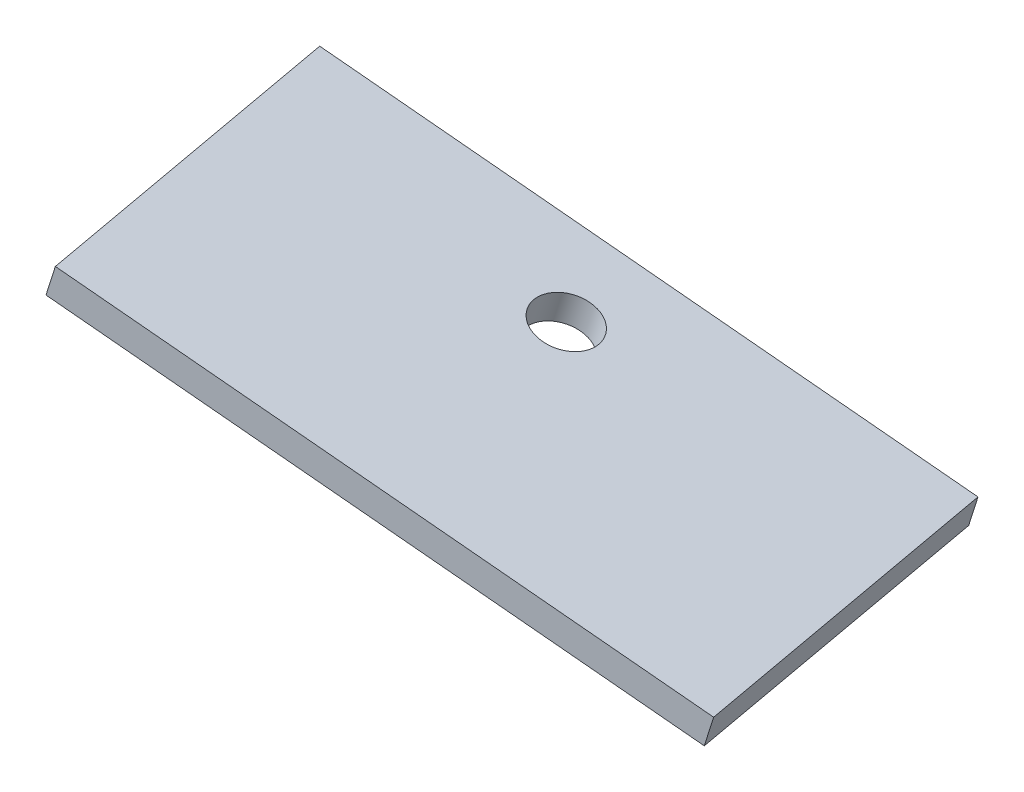
ISO-10303-21;
HEADER;
FILE_DESCRIPTION(('STEP AP214'),'2;1');
FILE_NAME('part.step','',(''),(''),'','','');
FILE_SCHEMA(('AUTOMOTIVE_DESIGN { 1 0 10303 214 1 1 1 1 }'));
ENDSEC;
DATA;
#1=APPLICATION_CONTEXT('core data for automotive mechanical design processes');
#2=APPLICATION_PROTOCOL_DEFINITION('international standard','automotive_design',2000,#1);
#3=PRODUCT_CONTEXT('',#1,'mechanical');
#4=PRODUCT('Part','Part','',(#3));
#5=PRODUCT_RELATED_PRODUCT_CATEGORY('part','',(#4));
#6=PRODUCT_DEFINITION_FORMATION('','',#4);
#7=PRODUCT_DEFINITION_CONTEXT('part definition',#1,'design');
#8=PRODUCT_DEFINITION('design','',#6,#7);
#9=PRODUCT_DEFINITION_SHAPE('','',#8);
#10=(LENGTH_UNIT() NAMED_UNIT(*) SI_UNIT(.MILLI.,.METRE.));
#11=(NAMED_UNIT(*) PLANE_ANGLE_UNIT() SI_UNIT($,.RADIAN.));
#12=(NAMED_UNIT(*) SI_UNIT($,.STERADIAN.) SOLID_ANGLE_UNIT());
#13=UNCERTAINTY_MEASURE_WITH_UNIT(LENGTH_MEASURE(1.E-05),#10,'distance_accuracy_value','');
#14=(GEOMETRIC_REPRESENTATION_CONTEXT(3) GLOBAL_UNCERTAINTY_ASSIGNED_CONTEXT((#13)) GLOBAL_UNIT_ASSIGNED_CONTEXT((#10,
#11,#12)) REPRESENTATION_CONTEXT('',''));
#15=CARTESIAN_POINT('',(0.,0.,0.));
#16=DIRECTION('',(0.,0.,1.));
#17=DIRECTION('',(1.,0.,0.));
#18=AXIS2_PLACEMENT_3D('',#15,#16,#17);
#19=CARTESIAN_POINT('',(301.223329106453,-73.6429692942688,480.400382547762));
#20=DIRECTION('',(0.178485715149537,0.,0.983942503141092));
#21=DIRECTION('',(0.983942503141092,0.,-0.178485715149537));
#22=AXIS2_PLACEMENT_3D('',#19,#20,#21);
#23=PLANE('',#22);
#24=DIRECTION('',(0.945853185860256,-0.275541830382092,-0.171576369316085));
#25=VECTOR('',#24,1.);
#26=CARTESIAN_POINT('',(301.765563743066,-71.7203911297098,480.302021986463));
#27=LINE('',#26,#25);
#28=CARTESIAN_POINT('',(301.765563743066,-71.7203911297098,480.302021986463));
#29=VERTEX_POINT('',#28);
#30=CARTESIAN_POINT('',(339.96359163014,-82.8480742398724,473.372956209793));
#31=VERTEX_POINT('',#30);
#32=EDGE_CURVE('E88',#29,#31,#27,.T.);
#33=ORIENTED_EDGE('',*,*,#32,.T.);
#34=DIRECTION('',(0.27111731830623,0.96128908227946,-0.0491802806493832));
#35=VECTOR('',#34,1.);
#36=CARTESIAN_POINT('',(339.421356993528,-84.7706524044313,473.471316771091));
#37=LINE('',#36,#35);
#38=CARTESIAN_POINT('',(339.421356993528,-84.7706524044313,473.471316771091));
#39=VERTEX_POINT('',#38);
#40=EDGE_CURVE('E42',#39,#31,#37,.T.);
#41=ORIENTED_EDGE('',*,*,#40,.F.);
#42=DIRECTION('',(0.945853185860256,-0.275541830382092,-0.171576369316085));
#43=VECTOR('',#42,1.);
#44=CARTESIAN_POINT('',(301.223329106453,-73.6429692942688,480.400382547762));
#45=LINE('',#44,#43);
#46=CARTESIAN_POINT('',(301.223329106453,-73.6429692942688,480.400382547762));
#47=VERTEX_POINT('',#46);
#48=EDGE_CURVE('E80',#47,#39,#45,.T.);
#49=ORIENTED_EDGE('',*,*,#48,.F.);
#50=DIRECTION('',(0.27111731830623,0.96128908227946,-0.0491802806493832));
#51=VECTOR('',#50,1.);
#52=CARTESIAN_POINT('',(301.223329106453,-73.6429692942688,480.400382547762));
#53=LINE('',#52,#51);
#54=EDGE_CURVE('E11',#47,#29,#53,.T.);
#55=ORIENTED_EDGE('',*,*,#54,.T.);
#56=EDGE_LOOP('',(#33,#41,#49,#55));
#57=FACE_BOUND('',#56,.T.);
#58=ADVANCED_FACE('F34',(#57),#23,.F.);
#59=CARTESIAN_POINT('',(343.437285584392,-84.7706524044308,495.610023091766));
#60=DIRECTION('',(-0.945853185860255,0.275541830382092,0.171576369316095));
#61=DIRECTION('',(-0.279689394053223,-0.960090538883777,0.));
#62=AXIS2_PLACEMENT_3D('',#59,#60,#61);
#63=PLANE('',#62);
#64=DIRECTION('',(0.178485715149546,0.,0.983942503141091));
#65=VECTOR('',#64,1.);
#66=CARTESIAN_POINT('',(343.979520221005,-82.8480742398719,495.511662530467));
#67=LINE('',#66,#65);
#68=CARTESIAN_POINT('',(343.979520221005,-82.8480742398719,495.511662530467));
#69=VERTEX_POINT('',#68);
#70=EDGE_CURVE('E67',#31,#69,#67,.T.);
#71=ORIENTED_EDGE('',*,*,#70,.T.);
#72=DIRECTION('',(0.27111731830623,0.96128908227946,-0.0491802806493832));
#73=VECTOR('',#72,1.);
#74=CARTESIAN_POINT('',(343.437285584392,-84.7706524044308,495.610023091766));
#75=LINE('',#74,#73);
#76=CARTESIAN_POINT('',(343.437285584392,-84.7706524044308,495.610023091766));
#77=VERTEX_POINT('',#76);
#78=EDGE_CURVE('E89',#77,#69,#75,.T.);
#79=ORIENTED_EDGE('',*,*,#78,.F.);
#80=DIRECTION('',(0.178485715149534,0.,0.983942503141093));
#81=VECTOR('',#80,1.);
#82=CARTESIAN_POINT('',(339.421356993528,-84.7706524044313,473.471316771091));
#83=LINE('',#82,#81);
#84=EDGE_CURVE('E84',#39,#77,#83,.T.);
#85=ORIENTED_EDGE('',*,*,#84,.F.);
#86=ORIENTED_EDGE('',*,*,#40,.T.);
#87=EDGE_LOOP('',(#71,#79,#85,#86));
#88=FACE_BOUND('',#87,.T.);
#89=ADVANCED_FACE('F90',(#88),#63,.F.);
#90=CARTESIAN_POINT('',(305.239257697318,-73.6429692942682,502.539088868436));
#91=DIRECTION('',(-0.178485715149545,0.,-0.983942503141091));
#92=DIRECTION('',(-0.983942503141091,0.,0.178485715149545));
#93=AXIS2_PLACEMENT_3D('',#90,#91,#92);
#94=PLANE('',#93);
#95=DIRECTION('',(-0.945853185860255,0.275541830382093,0.171576369316093));
#96=VECTOR('',#95,1.);
#97=CARTESIAN_POINT('',(305.78149233393,-71.7203911297093,502.440728307137));
#98=LINE('',#97,#96);
#99=CARTESIAN_POINT('',(305.78149233393,-71.7203911297093,502.440728307137));
#100=VERTEX_POINT('',#99);
#101=EDGE_CURVE('E74',#69,#100,#98,.T.);
#102=ORIENTED_EDGE('',*,*,#101,.T.);
#103=DIRECTION('',(0.27111731830623,0.96128908227946,-0.0491802806493832));
#104=VECTOR('',#103,1.);
#105=CARTESIAN_POINT('',(305.239257697318,-73.6429692942682,502.539088868436));
#106=LINE('',#105,#104);
#107=CARTESIAN_POINT('',(305.239257697318,-73.6429692942682,502.539088868436));
#108=VERTEX_POINT('',#107);
#109=EDGE_CURVE('E94',#108,#100,#106,.T.);
#110=ORIENTED_EDGE('',*,*,#109,.F.);
#111=DIRECTION('',(-0.945853185860255,0.275541830382093,0.171576369316093));
#112=VECTOR('',#111,1.);
#113=CARTESIAN_POINT('',(305.239257697318,-73.6429692942682,502.539088868436));
#114=LINE('',#113,#112);
#115=EDGE_CURVE('E92',#77,#108,#114,.T.);
#116=ORIENTED_EDGE('',*,*,#115,.F.);
#117=ORIENTED_EDGE('',*,*,#78,.T.);
#118=EDGE_LOOP('',(#102,#110,#116,#117));
#119=FACE_BOUND('',#118,.T.);
#120=ADVANCED_FACE('F105',(#119),#94,.F.);
#121=CARTESIAN_POINT('',(303.008186257949,-73.6429692942685,490.239807579172));
#122=DIRECTION('',(0.945853185860257,-0.275541830382092,-0.171576369316081));
#123=DIRECTION('',(0.279689394053222,0.960090538883777,0.));
#124=AXIS2_PLACEMENT_3D('',#121,#122,#123);
#125=PLANE('',#124);
#126=DIRECTION('',(-0.178485715149533,0.,-0.983942503141093));
#127=VECTOR('',#126,1.);
#128=CARTESIAN_POINT('',(303.550420894561,-71.7203911297096,490.141447017874));
#129=LINE('',#128,#127);
#130=EDGE_CURVE('E102',#100,#29,#129,.T.);
#131=ORIENTED_EDGE('',*,*,#130,.T.);
#132=ORIENTED_EDGE('',*,*,#54,.F.);
#133=DIRECTION('',(-0.17848571514954,0.,-0.983942503141092));
#134=VECTOR('',#133,1.);
#135=CARTESIAN_POINT('',(303.008186257949,-73.6429692942685,490.239807579172));
#136=LINE('',#135,#134);
#137=EDGE_CURVE('E50',#108,#47,#136,.T.);
#138=ORIENTED_EDGE('',*,*,#137,.F.);
#139=ORIENTED_EDGE('',*,*,#109,.T.);
#140=EDGE_LOOP('',(#131,#132,#138,#139));
#141=FACE_BOUND('',#140,.T.);
#142=ADVANCED_FACE('F109',(#141),#125,.F.);
#143=CARTESIAN_POINT('',(-3.4571651749431,-12.2579227290668,0.627124650749649));
#144=DIRECTION('',(-0.27111731830623,-0.96128908227946,0.0491802806493832));
#145=DIRECTION('',(0.962453730360486,-0.2714457900119,0.));
#146=AXIS2_PLACEMENT_3D('',#143,#144,#145);
#147=PLANE('',#146);
#148=CARTESIAN_POINT('',(320.690062878346,-79.0019593013298,482.96706311399));
#149=DIRECTION('',(-0.27111731830623,-0.96128908227946,0.0491802806493832));
#150=DIRECTION('',(0.962453730360486,-0.2714457900119,0.));
#151=AXIS2_PLACEMENT_3D('',#148,#149,#150);
#152=CIRCLE('',#151,2.);
#153=CARTESIAN_POINT('',(322.614970339067,-79.5448508813536,482.96706311399));
#154=VERTEX_POINT('',#153);
#155=EDGE_CURVE('E168',#154,#154,#152,.T.);
#156=ORIENTED_EDGE('',*,*,#155,.F.);
#157=EDGE_LOOP('',(#156));
#158=FACE_BOUND('',#157,.T.);
#159=ORIENTED_EDGE('',*,*,#137,.T.);
#160=ORIENTED_EDGE('',*,*,#48,.T.);
#161=ORIENTED_EDGE('',*,*,#84,.T.);
#162=ORIENTED_EDGE('',*,*,#115,.T.);
#163=EDGE_LOOP('',(#159,#160,#161,#162));
#164=FACE_BOUND('',#163,.T.);
#165=ADVANCED_FACE('F82',(#158,#164),#147,.T.);
#166=CARTESIAN_POINT('',(-2.91493053833064,-10.3353445645078,0.528764089450882));
#167=DIRECTION('',(-0.27111731830623,-0.96128908227946,0.0491802806493832));
#168=DIRECTION('',(0.962453730360486,-0.2714457900119,0.));
#169=AXIS2_PLACEMENT_3D('',#166,#167,#168);
#170=PLANE('',#169);
#171=CARTESIAN_POINT('',(321.232297514959,-77.0793811367709,482.868702552691));
#172=DIRECTION('',(-0.27111731830623,-0.96128908227946,0.0491802806493832));
#173=DIRECTION('',(0.962453730360486,-0.2714457900119,0.));
#174=AXIS2_PLACEMENT_3D('',#171,#172,#173);
#175=CIRCLE('',#174,2.);
#176=CARTESIAN_POINT('',(323.15720497568,-77.6222727167947,482.868702552691));
#177=VERTEX_POINT('',#176);
#178=EDGE_CURVE('E99',#177,#177,#175,.T.);
#179=ORIENTED_EDGE('',*,*,#178,.T.);
#180=EDGE_LOOP('',(#179));
#181=FACE_BOUND('',#180,.T.);
#182=ORIENTED_EDGE('',*,*,#32,.F.);
#183=ORIENTED_EDGE('',*,*,#130,.F.);
#184=ORIENTED_EDGE('',*,*,#101,.F.);
#185=ORIENTED_EDGE('',*,*,#70,.F.);
#186=EDGE_LOOP('',(#182,#183,#184,#185));
#187=FACE_BOUND('',#186,.T.);
#188=ADVANCED_FACE('F108',(#181,#187),#170,.F.);
#189=CARTESIAN_POINT('',(321.232297514959,-77.0793811367709,482.868702552691));
#190=DIRECTION('',(-0.27111731830623,-0.96128908227946,0.0491802806493832));
#191=DIRECTION('',(0.962453730360486,-0.2714457900119,0.));
#192=AXIS2_PLACEMENT_3D('',#189,#190,#191);
#193=CYLINDRICAL_SURFACE('',#192,2.);
#194=ORIENTED_EDGE('',*,*,#178,.F.);
#195=EDGE_LOOP('',(#194));
#196=FACE_BOUND('',#195,.T.);
#197=ORIENTED_EDGE('',*,*,#155,.T.);
#198=EDGE_LOOP('',(#197));
#199=FACE_BOUND('',#198,.T.);
#200=ADVANCED_FACE('F150',(#196,#199),#193,.F.);
#201=CLOSED_SHELL('',(#58,#89,#120,#142,#165,#188,#200));
#202=MANIFOLD_SOLID_BREP('B2',#201);
#203=ADVANCED_BREP_SHAPE_REPRESENTATION('',(#18,#202),#14);
#204=SHAPE_DEFINITION_REPRESENTATION(#9,#203);
ENDSEC;
END-ISO-10303-21;
